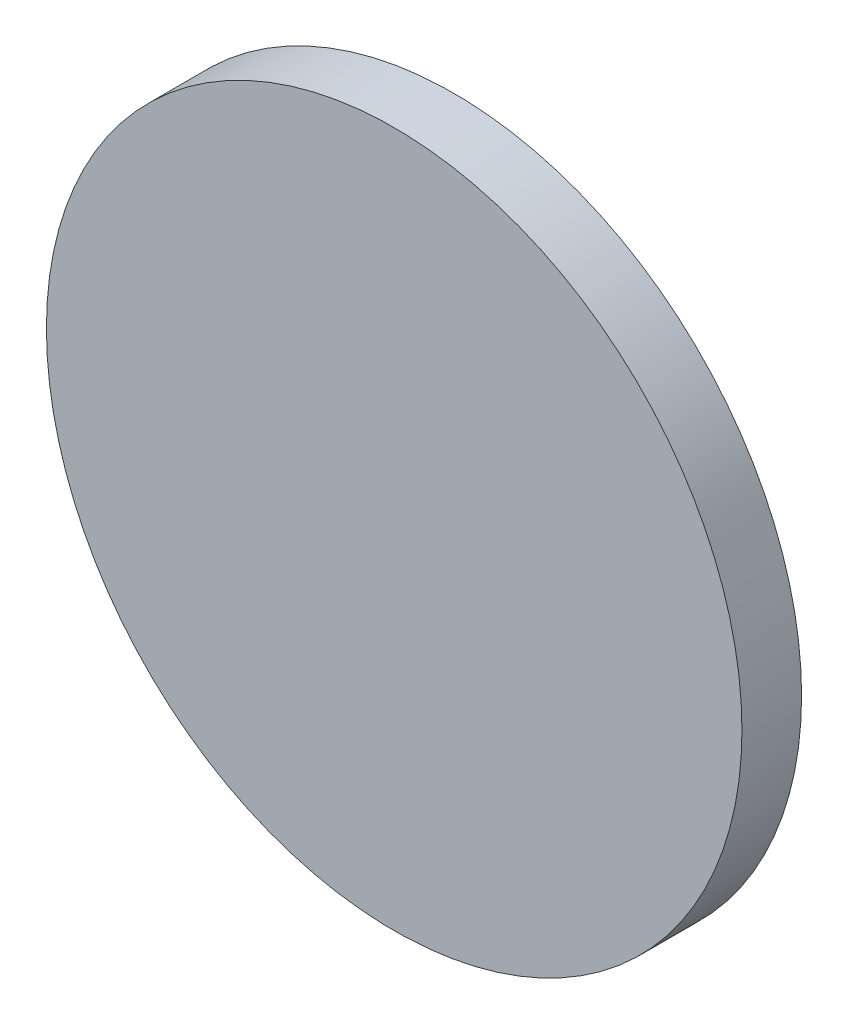
ISO-10303-21;
HEADER;
FILE_DESCRIPTION(('STEP AP214'),'2;1');
FILE_NAME('part.step','',(''),(''),'','','');
FILE_SCHEMA(('AUTOMOTIVE_DESIGN { 1 0 10303 214 1 1 1 1 }'));
ENDSEC;
DATA;
#1=APPLICATION_CONTEXT('core data for automotive mechanical design processes');
#2=APPLICATION_PROTOCOL_DEFINITION('international standard','automotive_design',2000,#1);
#3=PRODUCT_CONTEXT('',#1,'mechanical');
#4=PRODUCT('Part','Part','',(#3));
#5=PRODUCT_RELATED_PRODUCT_CATEGORY('part','',(#4));
#6=PRODUCT_DEFINITION_FORMATION('','',#4);
#7=PRODUCT_DEFINITION_CONTEXT('part definition',#1,'design');
#8=PRODUCT_DEFINITION('design','',#6,#7);
#9=PRODUCT_DEFINITION_SHAPE('','',#8);
#10=(LENGTH_UNIT() NAMED_UNIT(*) SI_UNIT(.MILLI.,.METRE.));
#11=(NAMED_UNIT(*) PLANE_ANGLE_UNIT() SI_UNIT($,.RADIAN.));
#12=(NAMED_UNIT(*) SI_UNIT($,.STERADIAN.) SOLID_ANGLE_UNIT());
#13=UNCERTAINTY_MEASURE_WITH_UNIT(LENGTH_MEASURE(1.E-05),#10,'distance_accuracy_value','');
#14=(GEOMETRIC_REPRESENTATION_CONTEXT(3) GLOBAL_UNCERTAINTY_ASSIGNED_CONTEXT((#13)) GLOBAL_UNIT_ASSIGNED_CONTEXT((#10,
#11,#12)) REPRESENTATION_CONTEXT('',''));
#15=CARTESIAN_POINT('',(0.,0.,0.));
#16=DIRECTION('',(0.,0.,1.));
#17=DIRECTION('',(1.,0.,0.));
#18=AXIS2_PLACEMENT_3D('',#15,#16,#17);
#19=CARTESIAN_POINT('',(5.55625,1.8415,0.));
#20=DIRECTION('',(0.,0.,-1.));
#21=DIRECTION('',(-1.,0.,0.));
#22=AXIS2_PLACEMENT_3D('',#19,#20,#21);
#23=PLANE('',#22);
#24=CARTESIAN_POINT('',(5.55625,1.8415,0.));
#25=DIRECTION('',(0.,0.,1.));
#26=DIRECTION('',(1.,0.,0.));
#27=AXIS2_PLACEMENT_3D('',#24,#25,#26);
#28=CIRCLE('',#27,0.200024667);
#29=CARTESIAN_POINT('',(5.756274667,1.8415,0.));
#30=VERTEX_POINT('',#29);
#31=EDGE_CURVE('E18',#30,#30,#28,.T.);
#32=ORIENTED_EDGE('',*,*,#31,.F.);
#33=EDGE_LOOP('',(#32));
#34=FACE_BOUND('',#33,.T.);
#35=ADVANCED_FACE('F15',(#34),#23,.T.);
#36=CARTESIAN_POINT('',(5.55625,1.8415,0.));
#37=DIRECTION('',(0.,0.,1.));
#38=DIRECTION('',(1.,0.,0.));
#39=AXIS2_PLACEMENT_3D('',#36,#37,#38);
#40=CYLINDRICAL_SURFACE('',#39,0.200024667);
#41=CARTESIAN_POINT('',(5.55625,1.8415,0.03429));
#42=DIRECTION('',(0.,0.,1.));
#43=DIRECTION('',(1.,0.,0.));
#44=AXIS2_PLACEMENT_3D('',#41,#42,#43);
#45=CIRCLE('',#44,0.200024667);
#46=CARTESIAN_POINT('',(5.756274667,1.8415,0.03429));
#47=VERTEX_POINT('',#46);
#48=EDGE_CURVE('E10',#47,#47,#45,.T.);
#49=ORIENTED_EDGE('',*,*,#48,.F.);
#50=EDGE_LOOP('',(#49));
#51=FACE_BOUND('',#50,.T.);
#52=ORIENTED_EDGE('',*,*,#31,.T.);
#53=EDGE_LOOP('',(#52));
#54=FACE_BOUND('',#53,.T.);
#55=ADVANCED_FACE('F27',(#51,#54),#40,.T.);
#56=CARTESIAN_POINT('',(5.55625,1.8415,0.03429));
#57=DIRECTION('',(0.,0.,1.));
#58=DIRECTION('',(1.,0.,0.));
#59=AXIS2_PLACEMENT_3D('',#56,#57,#58);
#60=PLANE('',#59);
#61=ORIENTED_EDGE('',*,*,#48,.T.);
#62=EDGE_LOOP('',(#61));
#63=FACE_BOUND('',#62,.T.);
#64=ADVANCED_FACE('F34',(#63),#60,.T.);
#65=CLOSED_SHELL('',(#35,#55,#64));
#66=MANIFOLD_SOLID_BREP('B1',#65);
#67=ADVANCED_BREP_SHAPE_REPRESENTATION('',(#18,#66),#14);
#68=SHAPE_DEFINITION_REPRESENTATION(#9,#67);
ENDSEC;
END-ISO-10303-21;
